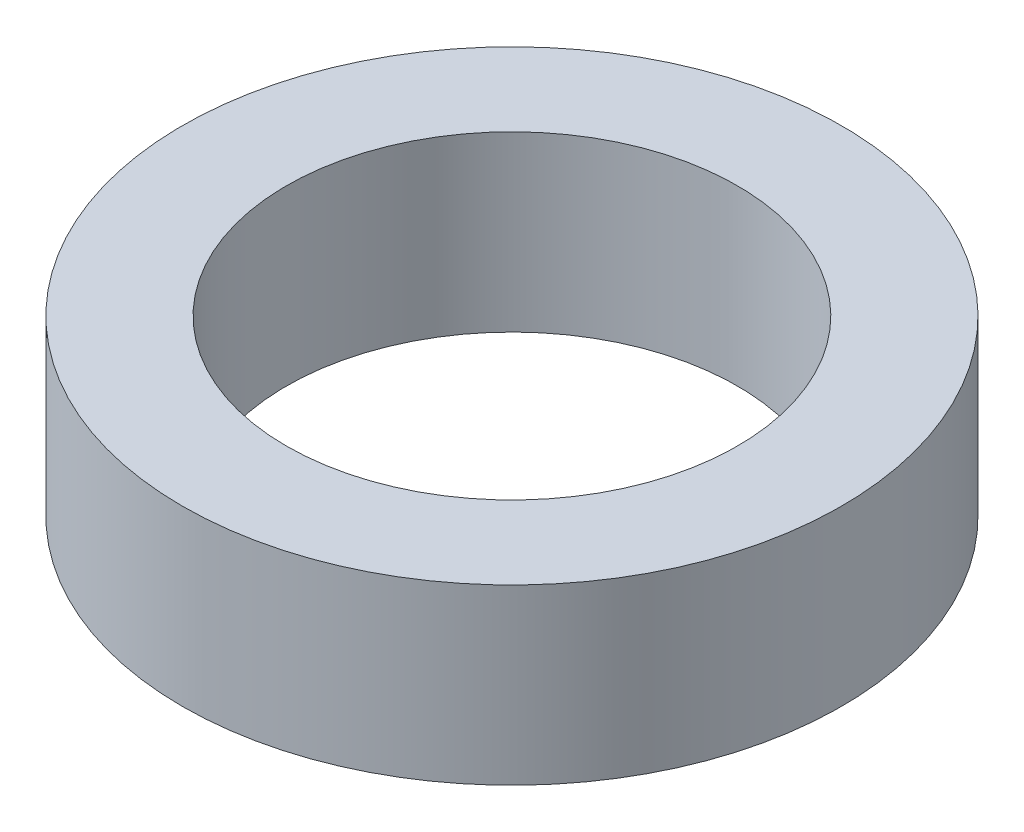
ISO-10303-21;
HEADER;
FILE_DESCRIPTION(('STEP AP214'),'2;1');
FILE_NAME('part.step','',(''),(''),'','','');
FILE_SCHEMA(('AUTOMOTIVE_DESIGN { 1 0 10303 214 1 1 1 1 }'));
ENDSEC;
DATA;
#1=APPLICATION_CONTEXT('core data for automotive mechanical design processes');
#2=APPLICATION_PROTOCOL_DEFINITION('international standard','automotive_design',2000,#1);
#3=PRODUCT_CONTEXT('',#1,'mechanical');
#4=PRODUCT('Part','Part','',(#3));
#5=PRODUCT_RELATED_PRODUCT_CATEGORY('part','',(#4));
#6=PRODUCT_DEFINITION_FORMATION('','',#4);
#7=PRODUCT_DEFINITION_CONTEXT('part definition',#1,'design');
#8=PRODUCT_DEFINITION('design','',#6,#7);
#9=PRODUCT_DEFINITION_SHAPE('','',#8);
#10=(LENGTH_UNIT() NAMED_UNIT(*) SI_UNIT(.MILLI.,.METRE.));
#11=(NAMED_UNIT(*) PLANE_ANGLE_UNIT() SI_UNIT($,.RADIAN.));
#12=(NAMED_UNIT(*) SI_UNIT($,.STERADIAN.) SOLID_ANGLE_UNIT());
#13=UNCERTAINTY_MEASURE_WITH_UNIT(LENGTH_MEASURE(1.E-05),#10,'distance_accuracy_value','');
#14=(GEOMETRIC_REPRESENTATION_CONTEXT(3) GLOBAL_UNCERTAINTY_ASSIGNED_CONTEXT((#13)) GLOBAL_UNIT_ASSIGNED_CONTEXT((#10,
#11,#12)) REPRESENTATION_CONTEXT('',''));
#15=CARTESIAN_POINT('',(0.,0.,0.));
#16=DIRECTION('',(0.,0.,1.));
#17=DIRECTION('',(1.,0.,0.));
#18=AXIS2_PLACEMENT_3D('',#15,#16,#17);
#19=CARTESIAN_POINT('',(0.,6.35,0.));
#20=DIRECTION('',(0.,1.,0.));
#21=DIRECTION('',(0.,0.,1.));
#22=AXIS2_PLACEMENT_3D('',#19,#20,#21);
#23=PLANE('',#22);
#24=CARTESIAN_POINT('',(0.,6.35,0.));
#25=DIRECTION('',(0.,1.,0.));
#26=DIRECTION('',(0.,0.,1.));
#27=AXIS2_PLACEMENT_3D('',#24,#25,#26);
#28=CIRCLE('',#27,12.065);
#29=CARTESIAN_POINT('',(0.,6.35,12.065));
#30=VERTEX_POINT('',#29);
#31=EDGE_CURVE('E10',#30,#30,#28,.T.);
#32=ORIENTED_EDGE('',*,*,#31,.T.);
#33=EDGE_LOOP('',(#32));
#34=FACE_BOUND('',#33,.T.);
#35=CARTESIAN_POINT('',(0.,6.35,0.));
#36=DIRECTION('',(0.,1.,0.));
#37=DIRECTION('',(0.,0.,1.));
#38=AXIS2_PLACEMENT_3D('',#35,#36,#37);
#39=CIRCLE('',#38,8.255);
#40=CARTESIAN_POINT('',(0.,6.35,8.255));
#41=VERTEX_POINT('',#40);
#42=EDGE_CURVE('E42',#41,#41,#39,.T.);
#43=ORIENTED_EDGE('',*,*,#42,.F.);
#44=EDGE_LOOP('',(#43));
#45=FACE_BOUND('',#44,.T.);
#46=ADVANCED_FACE('F31',(#34,#45),#23,.T.);
#47=CARTESIAN_POINT('',(0.,0.,0.));
#48=DIRECTION('',(0.,1.,0.));
#49=DIRECTION('',(0.,0.,1.));
#50=AXIS2_PLACEMENT_3D('',#47,#48,#49);
#51=PLANE('',#50);
#52=CARTESIAN_POINT('',(0.,0.,0.));
#53=DIRECTION('',(0.,1.,0.));
#54=DIRECTION('',(0.,0.,1.));
#55=AXIS2_PLACEMENT_3D('',#52,#53,#54);
#56=CIRCLE('',#55,12.065);
#57=CARTESIAN_POINT('',(0.,0.,12.065));
#58=VERTEX_POINT('',#57);
#59=EDGE_CURVE('E35',#58,#58,#56,.T.);
#60=ORIENTED_EDGE('',*,*,#59,.F.);
#61=EDGE_LOOP('',(#60));
#62=FACE_BOUND('',#61,.T.);
#63=CARTESIAN_POINT('',(0.,0.,0.));
#64=DIRECTION('',(0.,1.,0.));
#65=DIRECTION('',(0.,0.,1.));
#66=AXIS2_PLACEMENT_3D('',#63,#64,#65);
#67=CIRCLE('',#66,8.255);
#68=CARTESIAN_POINT('',(0.,0.,8.255));
#69=VERTEX_POINT('',#68);
#70=EDGE_CURVE('E44',#69,#69,#67,.T.);
#71=ORIENTED_EDGE('',*,*,#70,.T.);
#72=EDGE_LOOP('',(#71));
#73=FACE_BOUND('',#72,.T.);
#74=ADVANCED_FACE('F54',(#62,#73),#51,.F.);
#75=CARTESIAN_POINT('',(0.,6.35,0.));
#76=DIRECTION('',(0.,-1.,0.));
#77=DIRECTION('',(0.,0.,-1.));
#78=AXIS2_PLACEMENT_3D('',#75,#76,#77);
#79=CYLINDRICAL_SURFACE('',#78,12.065);
#80=ORIENTED_EDGE('',*,*,#31,.F.);
#81=EDGE_LOOP('',(#80));
#82=FACE_BOUND('',#81,.T.);
#83=ORIENTED_EDGE('',*,*,#59,.T.);
#84=EDGE_LOOP('',(#83));
#85=FACE_BOUND('',#84,.T.);
#86=ADVANCED_FACE('F33',(#82,#85),#79,.T.);
#87=CARTESIAN_POINT('',(0.,6.35,0.));
#88=DIRECTION('',(0.,-1.,0.));
#89=DIRECTION('',(0.,0.,-1.));
#90=AXIS2_PLACEMENT_3D('',#87,#88,#89);
#91=CYLINDRICAL_SURFACE('',#90,8.255);
#92=ORIENTED_EDGE('',*,*,#42,.T.);
#93=EDGE_LOOP('',(#92));
#94=FACE_BOUND('',#93,.T.);
#95=ORIENTED_EDGE('',*,*,#70,.F.);
#96=EDGE_LOOP('',(#95));
#97=FACE_BOUND('',#96,.T.);
#98=ADVANCED_FACE('F50',(#94,#97),#91,.F.);
#99=CLOSED_SHELL('',(#46,#74,#86,#98));
#100=MANIFOLD_SOLID_BREP('B2',#99);
#101=ADVANCED_BREP_SHAPE_REPRESENTATION('',(#18,#100),#14);
#102=SHAPE_DEFINITION_REPRESENTATION(#9,#101);
ENDSEC;
END-ISO-10303-21;
